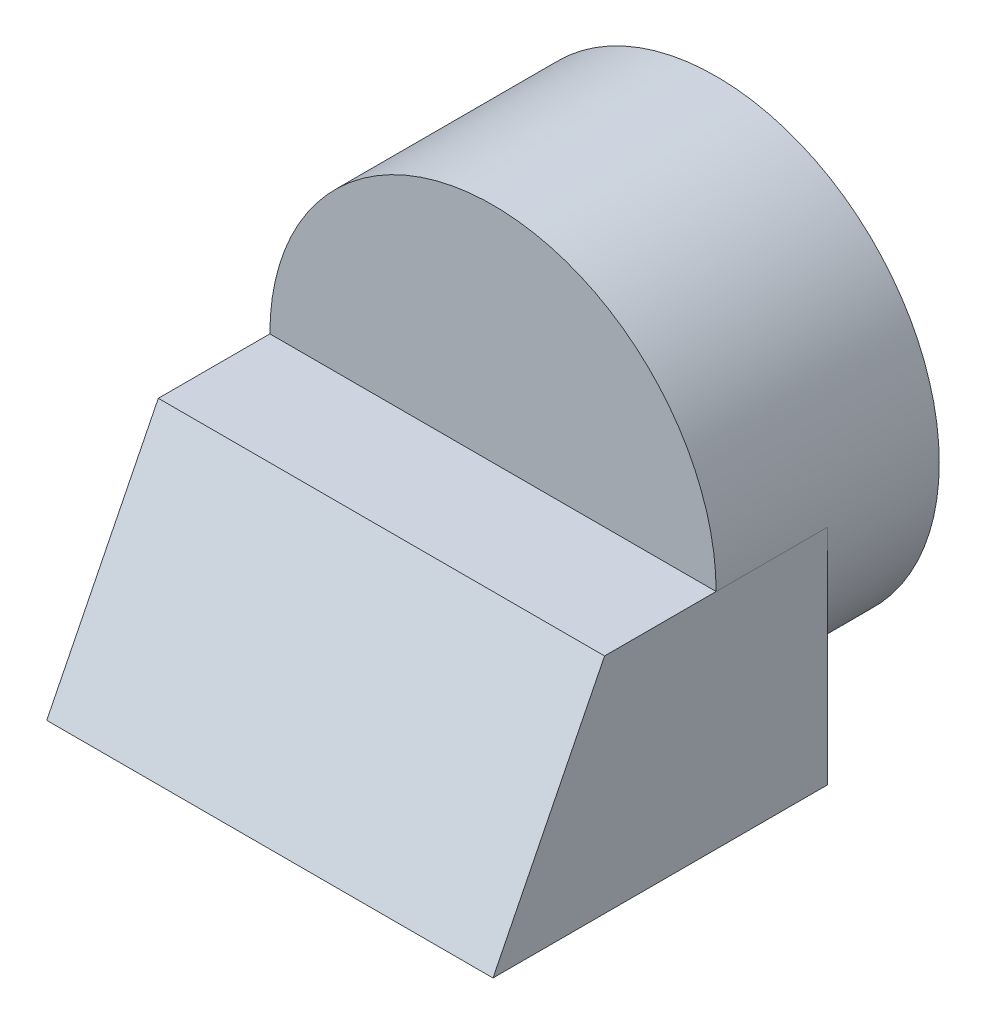
ISO-10303-21;
HEADER;
FILE_DESCRIPTION(('STEP AP214'),'2;1');
FILE_NAME('part.step','',(''),(''),'','','');
FILE_SCHEMA(('AUTOMOTIVE_DESIGN { 1 0 10303 214 1 1 1 1 }'));
ENDSEC;
DATA;
#1=APPLICATION_CONTEXT('core data for automotive mechanical design processes');
#2=APPLICATION_PROTOCOL_DEFINITION('international standard','automotive_design',2000,#1);
#3=PRODUCT_CONTEXT('',#1,'mechanical');
#4=PRODUCT('Part','Part','',(#3));
#5=PRODUCT_RELATED_PRODUCT_CATEGORY('part','',(#4));
#6=PRODUCT_DEFINITION_FORMATION('','',#4);
#7=PRODUCT_DEFINITION_CONTEXT('part definition',#1,'design');
#8=PRODUCT_DEFINITION('design','',#6,#7);
#9=PRODUCT_DEFINITION_SHAPE('','',#8);
#10=(LENGTH_UNIT() NAMED_UNIT(*) SI_UNIT(.MILLI.,.METRE.));
#11=(NAMED_UNIT(*) PLANE_ANGLE_UNIT() SI_UNIT($,.RADIAN.));
#12=(NAMED_UNIT(*) SI_UNIT($,.STERADIAN.) SOLID_ANGLE_UNIT());
#13=UNCERTAINTY_MEASURE_WITH_UNIT(LENGTH_MEASURE(1.E-05),#10,'distance_accuracy_value','');
#14=(GEOMETRIC_REPRESENTATION_CONTEXT(3) GLOBAL_UNCERTAINTY_ASSIGNED_CONTEXT((#13)) GLOBAL_UNIT_ASSIGNED_CONTEXT((#10,
#11,#12)) REPRESENTATION_CONTEXT('',''));
#15=CARTESIAN_POINT('',(0.,0.,0.));
#16=DIRECTION('',(0.,0.,1.));
#17=DIRECTION('',(1.,0.,0.));
#18=AXIS2_PLACEMENT_3D('',#15,#16,#17);
#19=CARTESIAN_POINT('',(-2.,4.,-2.));
#20=DIRECTION('',(0.,0.,1.));
#21=DIRECTION('',(1.,0.,0.));
#22=AXIS2_PLACEMENT_3D('',#19,#20,#21);
#23=PLANE('',#22);
#24=CARTESIAN_POINT('',(0.,2.,-2.));
#25=DIRECTION('',(0.,0.,1.));
#26=DIRECTION('',(1.,0.,0.));
#27=AXIS2_PLACEMENT_3D('',#24,#25,#26);
#28=CIRCLE('',#27,2.);
#29=CARTESIAN_POINT('',(2.,2.,-2.));
#30=VERTEX_POINT('',#29);
#31=EDGE_CURVE('E168',#30,#30,#28,.F.);
#32=ORIENTED_EDGE('',*,*,#31,.T.);
#33=EDGE_LOOP('',(#32));
#34=FACE_BOUND('',#33,.T.);
#35=ADVANCED_FACE('F69',(#34),#23,.F.);
#36=CARTESIAN_POINT('',(-2.,4.,2.));
#37=DIRECTION('',(1.,0.,0.));
#38=DIRECTION('',(0.,0.,-1.));
#39=AXIS2_PLACEMENT_3D('',#36,#37,#38);
#40=PLANE('',#39);
#41=DIRECTION('',(0.,1.,0.));
#42=VECTOR('',#41,1.);
#43=CARTESIAN_POINT('',(-2.,0.,-1.));
#44=LINE('',#43,#42);
#45=CARTESIAN_POINT('',(-2.,0.,-1.));
#46=VERTEX_POINT('',#45);
#47=CARTESIAN_POINT('',(-2.,2.,-1.));
#48=VERTEX_POINT('',#47);
#49=EDGE_CURVE('E133',#46,#48,#44,.T.);
#50=ORIENTED_EDGE('',*,*,#49,.F.);
#51=DIRECTION('',(0.,0.,1.));
#52=VECTOR('',#51,1.);
#53=CARTESIAN_POINT('',(-2.,0.,2.));
#54=LINE('',#53,#52);
#55=CARTESIAN_POINT('',(-2.,0.,2.));
#56=VERTEX_POINT('',#55);
#57=EDGE_CURVE('E107',#46,#56,#54,.T.);
#58=ORIENTED_EDGE('',*,*,#57,.T.);
#59=DIRECTION('',(0.,-0.894427190999916,0.447213595499958));
#60=VECTOR('',#59,1.);
#61=CARTESIAN_POINT('',(-2.,0.,2.));
#62=LINE('',#61,#60);
#63=CARTESIAN_POINT('',(-2.,2.,1.));
#64=VERTEX_POINT('',#63);
#65=EDGE_CURVE('E154',#64,#56,#62,.T.);
#66=ORIENTED_EDGE('',*,*,#65,.F.);
#67=DIRECTION('',(0.,0.,1.));
#68=VECTOR('',#67,1.);
#69=CARTESIAN_POINT('',(-2.,2.,1.));
#70=LINE('',#69,#68);
#71=CARTESIAN_POINT('',(-2.,2.,0.));
#72=VERTEX_POINT('',#71);
#73=EDGE_CURVE('E151',#72,#64,#70,.T.);
#74=ORIENTED_EDGE('',*,*,#73,.F.);
#75=DIRECTION('',(0.,0.,1.));
#76=VECTOR('',#75,1.);
#77=CARTESIAN_POINT('',(-2.,2.,-2.));
#78=LINE('',#77,#76);
#79=EDGE_CURVE('E83',#48,#72,#78,.T.);
#80=ORIENTED_EDGE('',*,*,#79,.F.);
#81=EDGE_LOOP('',(#50,#58,#66,#74,#80));
#82=FACE_BOUND('',#81,.T.);
#83=ADVANCED_FACE('F181',(#82),#40,.F.);
#84=CARTESIAN_POINT('',(0.,0.,0.));
#85=DIRECTION('',(0.,-1.,0.));
#86=DIRECTION('',(0.,0.,-1.));
#87=AXIS2_PLACEMENT_3D('',#84,#85,#86);
#88=PLANE('',#87);
#89=ORIENTED_EDGE('',*,*,#57,.F.);
#90=DIRECTION('',(-1.,0.,0.));
#91=VECTOR('',#90,1.);
#92=CARTESIAN_POINT('',(0.,0.,-1.));
#93=LINE('',#92,#91);
#94=CARTESIAN_POINT('',(0.,0.,-1.));
#95=VERTEX_POINT('',#94);
#96=EDGE_CURVE('E132',#95,#46,#93,.T.);
#97=ORIENTED_EDGE('',*,*,#96,.F.);
#98=DIRECTION('',(-1.,0.,0.));
#99=VECTOR('',#98,1.);
#100=CARTESIAN_POINT('',(0.,0.,-1.));
#101=LINE('',#100,#99);
#102=CARTESIAN_POINT('',(2.,0.,-1.));
#103=VERTEX_POINT('',#102);
#104=EDGE_CURVE('E141',#103,#95,#101,.T.);
#105=ORIENTED_EDGE('',*,*,#104,.F.);
#106=DIRECTION('',(0.,0.,-1.));
#107=VECTOR('',#106,1.);
#108=CARTESIAN_POINT('',(2.,0.,2.));
#109=LINE('',#108,#107);
#110=CARTESIAN_POINT('',(2.,0.,2.));
#111=VERTEX_POINT('',#110);
#112=EDGE_CURVE('E172',#111,#103,#109,.T.);
#113=ORIENTED_EDGE('',*,*,#112,.F.);
#114=DIRECTION('',(1.,0.,0.));
#115=VECTOR('',#114,1.);
#116=CARTESIAN_POINT('',(-2.,0.,2.));
#117=LINE('',#116,#115);
#118=EDGE_CURVE('E77',#56,#111,#117,.T.);
#119=ORIENTED_EDGE('',*,*,#118,.F.);
#120=EDGE_LOOP('',(#89,#97,#105,#113,#119));
#121=FACE_BOUND('',#120,.T.);
#122=ADVANCED_FACE('F138',(#121),#88,.T.);
#123=CARTESIAN_POINT('',(2.,4.,2.));
#124=DIRECTION('',(-1.,0.,0.));
#125=DIRECTION('',(0.,0.,1.));
#126=AXIS2_PLACEMENT_3D('',#123,#124,#125);
#127=PLANE('',#126);
#128=DIRECTION('',(0.,-1.,0.));
#129=VECTOR('',#128,1.);
#130=CARTESIAN_POINT('',(2.,0.,-1.));
#131=LINE('',#130,#129);
#132=CARTESIAN_POINT('',(2.,2.,-1.));
#133=VERTEX_POINT('',#132);
#134=EDGE_CURVE('E148',#133,#103,#131,.T.);
#135=ORIENTED_EDGE('',*,*,#134,.F.);
#136=DIRECTION('',(0.,0.,1.));
#137=VECTOR('',#136,1.);
#138=CARTESIAN_POINT('',(2.,2.,-2.));
#139=LINE('',#138,#137);
#140=CARTESIAN_POINT('',(2.,2.,0.));
#141=VERTEX_POINT('',#140);
#142=EDGE_CURVE('E113',#133,#141,#139,.T.);
#143=ORIENTED_EDGE('',*,*,#142,.T.);
#144=DIRECTION('',(0.,0.,1.));
#145=VECTOR('',#144,1.);
#146=CARTESIAN_POINT('',(2.,2.,1.));
#147=LINE('',#146,#145);
#148=CARTESIAN_POINT('',(2.,2.,1.));
#149=VERTEX_POINT('',#148);
#150=EDGE_CURVE('E158',#141,#149,#147,.T.);
#151=ORIENTED_EDGE('',*,*,#150,.T.);
#152=DIRECTION('',(0.,-0.894427190999916,0.447213595499958));
#153=VECTOR('',#152,1.);
#154=CARTESIAN_POINT('',(2.,0.,2.));
#155=LINE('',#154,#153);
#156=EDGE_CURVE('E160',#149,#111,#155,.T.);
#157=ORIENTED_EDGE('',*,*,#156,.T.);
#158=ORIENTED_EDGE('',*,*,#112,.T.);
#159=EDGE_LOOP('',(#135,#143,#151,#157,#158));
#160=FACE_BOUND('',#159,.T.);
#161=ADVANCED_FACE('F71',(#160),#127,.F.);
#162=CARTESIAN_POINT('',(0.,2.,-2.));
#163=DIRECTION('',(0.,0.,1.));
#164=DIRECTION('',(1.,0.,0.));
#165=AXIS2_PLACEMENT_3D('',#162,#163,#164);
#166=CYLINDRICAL_SURFACE('',#165,2.);
#167=CARTESIAN_POINT('',(0.,2.,-1.));
#168=DIRECTION('',(0.,0.,-1.));
#169=DIRECTION('',(-1.,0.,0.));
#170=AXIS2_PLACEMENT_3D('',#167,#168,#169);
#171=CIRCLE('',#170,2.);
#172=EDGE_CURVE('E129',#95,#48,#171,.T.);
#173=ORIENTED_EDGE('',*,*,#172,.T.);
#174=ORIENTED_EDGE('',*,*,#79,.T.);
#175=CARTESIAN_POINT('',(0.,2.,0.));
#176=DIRECTION('',(0.,0.,-1.));
#177=DIRECTION('',(0.,1.,0.));
#178=AXIS2_PLACEMENT_3D('',#175,#176,#177);
#179=CIRCLE('',#178,2.);
#180=EDGE_CURVE('E12',#72,#141,#179,.T.);
#181=ORIENTED_EDGE('',*,*,#180,.T.);
#182=ORIENTED_EDGE('',*,*,#142,.F.);
#183=CARTESIAN_POINT('',(0.,2.,-1.));
#184=DIRECTION('',(0.,0.,-1.));
#185=DIRECTION('',(-1.,0.,0.));
#186=AXIS2_PLACEMENT_3D('',#183,#184,#185);
#187=CIRCLE('',#186,2.);
#188=EDGE_CURVE('E144',#133,#95,#187,.T.);
#189=ORIENTED_EDGE('',*,*,#188,.T.);
#190=EDGE_LOOP('',(#173,#174,#181,#182,#189));
#191=FACE_BOUND('',#190,.T.);
#192=ORIENTED_EDGE('',*,*,#31,.F.);
#193=EDGE_LOOP('',(#192));
#194=FACE_BOUND('',#193,.T.);
#195=ADVANCED_FACE('F145',(#191,#194),#166,.T.);
#196=CARTESIAN_POINT('',(2.,2.,0.));
#197=DIRECTION('',(0.,0.,-1.));
#198=DIRECTION('',(0.,1.,0.));
#199=AXIS2_PLACEMENT_3D('',#196,#197,#198);
#200=PLANE('',#199);
#201=ORIENTED_EDGE('',*,*,#180,.F.);
#202=DIRECTION('',(-1.,0.,0.));
#203=VECTOR('',#202,1.);
#204=CARTESIAN_POINT('',(2.,2.,0.));
#205=LINE('',#204,#203);
#206=EDGE_CURVE('E161',#141,#72,#205,.T.);
#207=ORIENTED_EDGE('',*,*,#206,.F.);
#208=EDGE_LOOP('',(#201,#207));
#209=FACE_BOUND('',#208,.T.);
#210=ADVANCED_FACE('F193',(#209),#200,.F.);
#211=CARTESIAN_POINT('',(2.,0.,2.));
#212=DIRECTION('',(0.,-0.447213595499958,-0.894427190999916));
#213=DIRECTION('',(0.,0.894427190999916,-0.447213595499958));
#214=AXIS2_PLACEMENT_3D('',#211,#212,#213);
#215=PLANE('',#214);
#216=ORIENTED_EDGE('',*,*,#65,.T.);
#217=ORIENTED_EDGE('',*,*,#118,.T.);
#218=ORIENTED_EDGE('',*,*,#156,.F.);
#219=DIRECTION('',(-1.,0.,0.));
#220=VECTOR('',#219,1.);
#221=CARTESIAN_POINT('',(2.,2.,1.));
#222=LINE('',#221,#220);
#223=EDGE_CURVE('E164',#149,#64,#222,.T.);
#224=ORIENTED_EDGE('',*,*,#223,.T.);
#225=EDGE_LOOP('',(#216,#217,#218,#224));
#226=FACE_BOUND('',#225,.T.);
#227=ADVANCED_FACE('F175',(#226),#215,.F.);
#228=CARTESIAN_POINT('',(2.,2.,1.));
#229=DIRECTION('',(0.,-1.,0.));
#230=DIRECTION('',(0.,0.,-1.));
#231=AXIS2_PLACEMENT_3D('',#228,#229,#230);
#232=PLANE('',#231);
#233=ORIENTED_EDGE('',*,*,#73,.T.);
#234=ORIENTED_EDGE('',*,*,#223,.F.);
#235=ORIENTED_EDGE('',*,*,#150,.F.);
#236=ORIENTED_EDGE('',*,*,#206,.T.);
#237=EDGE_LOOP('',(#233,#234,#235,#236));
#238=FACE_BOUND('',#237,.T.);
#239=ADVANCED_FACE('F178',(#238),#232,.F.);
#240=CARTESIAN_POINT('',(0.,0.,-1.));
#241=DIRECTION('',(0.,0.,-1.));
#242=DIRECTION('',(-1.,0.,0.));
#243=AXIS2_PLACEMENT_3D('',#240,#241,#242);
#244=PLANE('',#243);
#245=ORIENTED_EDGE('',*,*,#188,.F.);
#246=ORIENTED_EDGE('',*,*,#134,.T.);
#247=ORIENTED_EDGE('',*,*,#104,.T.);
#248=EDGE_LOOP('',(#245,#246,#247));
#249=FACE_BOUND('',#248,.T.);
#250=ADVANCED_FACE('F150',(#249),#244,.T.);
#251=CARTESIAN_POINT('',(0.,0.,-1.));
#252=DIRECTION('',(0.,0.,-1.));
#253=DIRECTION('',(-1.,0.,0.));
#254=AXIS2_PLACEMENT_3D('',#251,#252,#253);
#255=PLANE('',#254);
#256=ORIENTED_EDGE('',*,*,#172,.F.);
#257=ORIENTED_EDGE('',*,*,#96,.T.);
#258=ORIENTED_EDGE('',*,*,#49,.T.);
#259=EDGE_LOOP('',(#256,#257,#258));
#260=FACE_BOUND('',#259,.T.);
#261=ADVANCED_FACE('F131',(#260),#255,.T.);
#262=CLOSED_SHELL('',(#35,#83,#122,#161,#195,#210,#227,#239,#250,#261));
#263=MANIFOLD_SOLID_BREP('B2',#262);
#264=ADVANCED_BREP_SHAPE_REPRESENTATION('',(#18,#263),#14);
#265=SHAPE_DEFINITION_REPRESENTATION(#9,#264);
ENDSEC;
END-ISO-10303-21;
